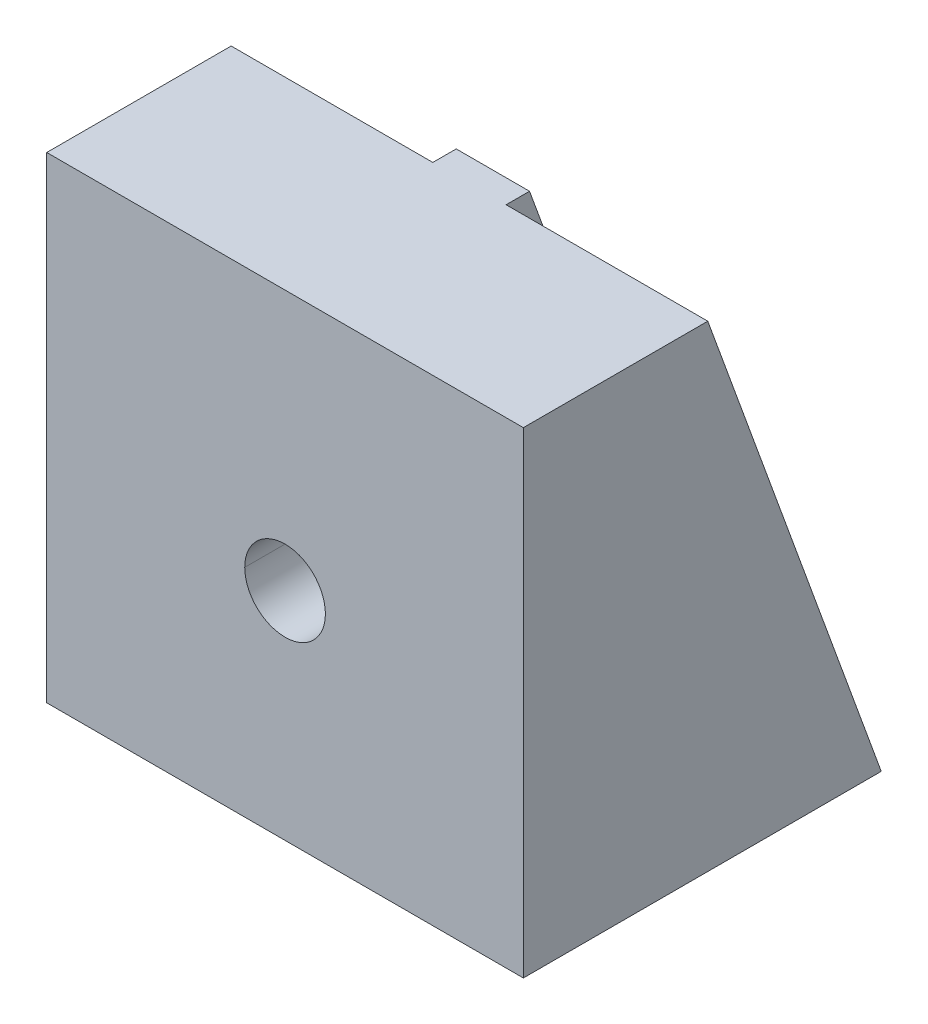
ISO-10303-21;
HEADER;
FILE_DESCRIPTION(('STEP AP214'),'2;1');
FILE_NAME('part.step','',(''),(''),'','','');
FILE_SCHEMA(('AUTOMOTIVE_DESIGN { 1 0 10303 214 1 1 1 1 }'));
ENDSEC;
DATA;
#1=APPLICATION_CONTEXT('core data for automotive mechanical design processes');
#2=APPLICATION_PROTOCOL_DEFINITION('international standard','automotive_design',2000,#1);
#3=PRODUCT_CONTEXT('',#1,'mechanical');
#4=PRODUCT('Part','Part','',(#3));
#5=PRODUCT_RELATED_PRODUCT_CATEGORY('part','',(#4));
#6=PRODUCT_DEFINITION_FORMATION('','',#4);
#7=PRODUCT_DEFINITION_CONTEXT('part definition',#1,'design');
#8=PRODUCT_DEFINITION('design','',#6,#7);
#9=PRODUCT_DEFINITION_SHAPE('','',#8);
#10=(LENGTH_UNIT() NAMED_UNIT(*) SI_UNIT(.MILLI.,.METRE.));
#11=(NAMED_UNIT(*) PLANE_ANGLE_UNIT() SI_UNIT($,.RADIAN.));
#12=(NAMED_UNIT(*) SI_UNIT($,.STERADIAN.) SOLID_ANGLE_UNIT());
#13=UNCERTAINTY_MEASURE_WITH_UNIT(LENGTH_MEASURE(1.E-05),#10,'distance_accuracy_value','');
#14=(GEOMETRIC_REPRESENTATION_CONTEXT(3) GLOBAL_UNCERTAINTY_ASSIGNED_CONTEXT((#13)) GLOBAL_UNIT_ASSIGNED_CONTEXT((#10,
#11,#12)) REPRESENTATION_CONTEXT('',''));
#15=CARTESIAN_POINT('',(0.,0.,0.));
#16=DIRECTION('',(0.,0.,1.));
#17=DIRECTION('',(1.,0.,0.));
#18=AXIS2_PLACEMENT_3D('',#15,#16,#17);
#19=CARTESIAN_POINT('',(0.,29.50000000001,-26.89999999999));
#20=DIRECTION('',(0.,0.,-1.));
#21=DIRECTION('',(-1.,0.,0.));
#22=AXIS2_PLACEMENT_3D('',#19,#20,#21);
#23=PLANE('',#22);
#24=CARTESIAN_POINT('',(0.,29.50000000001,-26.89999999999));
#25=DIRECTION('',(0.,0.,1.));
#26=DIRECTION('',(1.,0.,0.));
#27=AXIS2_PLACEMENT_3D('',#24,#25,#26);
#28=CIRCLE('',#27,3.1);
#29=CARTESIAN_POINT('',(-3.1,29.50000000001,-26.89999999999));
#30=VERTEX_POINT('',#29);
#31=CARTESIAN_POINT('',(3.1,29.50000000001,-26.89999999999));
#32=VERTEX_POINT('',#31);
#33=EDGE_CURVE('E112',#30,#32,#28,.T.);
#34=ORIENTED_EDGE('',*,*,#33,.T.);
#35=CARTESIAN_POINT('',(0.,29.50000000001,-26.89999999999));
#36=DIRECTION('',(0.,0.,1.));
#37=DIRECTION('',(1.,0.,0.));
#38=AXIS2_PLACEMENT_3D('',#35,#36,#37);
#39=CIRCLE('',#38,3.1);
#40=EDGE_CURVE('E111',#32,#30,#39,.T.);
#41=ORIENTED_EDGE('',*,*,#40,.T.);
#42=EDGE_LOOP('',(#34,#41));
#43=FACE_BOUND('',#42,.T.);
#44=CARTESIAN_POINT('',(0.,29.50000000001,-26.89999999999));
#45=DIRECTION('',(0.,0.,-1.));
#46=DIRECTION('',(-1.,0.,0.));
#47=AXIS2_PLACEMENT_3D('',#44,#45,#46);
#48=CIRCLE('',#47,13.);
#49=CARTESIAN_POINT('',(13.,29.50000000001,-26.89999999999));
#50=VERTEX_POINT('',#49);
#51=CARTESIAN_POINT('',(-13.,29.50000000001,-26.89999999999));
#52=VERTEX_POINT('',#51);
#53=EDGE_CURVE('E18',#50,#52,#48,.T.);
#54=ORIENTED_EDGE('',*,*,#53,.T.);
#55=CARTESIAN_POINT('',(0.,29.50000000001,-26.89999999999));
#56=DIRECTION('',(0.,0.,-1.));
#57=DIRECTION('',(-1.,0.,0.));
#58=AXIS2_PLACEMENT_3D('',#55,#56,#57);
#59=CIRCLE('',#58,13.);
#60=EDGE_CURVE('E97',#52,#50,#59,.T.);
#61=ORIENTED_EDGE('',*,*,#60,.T.);
#62=EDGE_LOOP('',(#54,#61));
#63=FACE_BOUND('',#62,.T.);
#64=ADVANCED_FACE('F15',(#43,#63),#23,.T.);
#65=CARTESIAN_POINT('',(0.,29.50000000001,-26.89999999999));
#66=DIRECTION('',(0.,0.,-1.));
#67=DIRECTION('',(-1.,0.,0.));
#68=AXIS2_PLACEMENT_3D('',#65,#66,#67);
#69=CYLINDRICAL_SURFACE('',#68,13.);
#70=CARTESIAN_POINT('',(0.,29.50000000001,-38.0703447717141));
#71=DIRECTION('',(0.,0.342020143325699,-0.939692620785897));
#72=DIRECTION('',(0.,-0.939692620785897,-0.342020143325699));
#73=AXIS2_PLACEMENT_3D('',#70,#71,#72);
#74=ELLIPSE('',#73,13.834311042187,13.);
#75=CARTESIAN_POINT('',(5.,17.500000000005,-42.4379875829108));
#76=VERTEX_POINT('',#75);
#77=CARTESIAN_POINT('',(13.,29.5000000000096,-38.070344771716));
#78=VERTEX_POINT('',#77);
#79=EDGE_CURVE('E122',#76,#78,#74,.F.);
#80=ORIENTED_EDGE('',*,*,#79,.F.);
#81=DIRECTION('',(0.,0.,-1.));
#82=VECTOR('',#81,1.);
#83=CARTESIAN_POINT('',(5.,17.5,-25.02655820628));
#84=LINE('',#83,#82);
#85=CARTESIAN_POINT('',(4.9999999999995,17.5000000000048,-45.6305209003384));
#86=VERTEX_POINT('',#85);
#87=EDGE_CURVE('E121',#86,#76,#84,.F.);
#88=ORIENTED_EDGE('',*,*,#87,.F.);
#89=CARTESIAN_POINT('',(0.,29.50000000001,-41.2628780891416));
#90=DIRECTION('',(0.,0.342020143325699,-0.939692620785897));
#91=DIRECTION('',(0.,-0.939692620785897,-0.342020143325699));
#92=AXIS2_PLACEMENT_3D('',#89,#90,#91);
#93=ELLIPSE('',#92,13.834311042187,13.);
#94=CARTESIAN_POINT('',(-5.,17.50000000001,-45.6305209003383));
#95=VERTEX_POINT('',#94);
#96=EDGE_CURVE('E117',#95,#86,#93,.F.);
#97=ORIENTED_EDGE('',*,*,#96,.F.);
#98=DIRECTION('',(0.,0.,-1.));
#99=VECTOR('',#98,1.);
#100=CARTESIAN_POINT('',(-5.,17.50000000001,-25.02655820628));
#101=LINE('',#100,#99);
#102=CARTESIAN_POINT('',(-5.,17.50000000001,-42.437987582909));
#103=VERTEX_POINT('',#102);
#104=EDGE_CURVE('E163',#95,#103,#101,.F.);
#105=ORIENTED_EDGE('',*,*,#104,.T.);
#106=CARTESIAN_POINT('',(0.,29.50000000001,-38.0703447717141));
#107=DIRECTION('',(0.,-0.342020143325699,0.939692620785897));
#108=DIRECTION('',(0.,-0.939692620785897,-0.342020143325699));
#109=AXIS2_PLACEMENT_3D('',#106,#107,#108);
#110=ELLIPSE('',#109,13.834311042187,13.);
#111=CARTESIAN_POINT('',(-13.,29.5000000000096,-38.070344771716));
#112=VERTEX_POINT('',#111);
#113=EDGE_CURVE('E105',#103,#112,#110,.F.);
#114=ORIENTED_EDGE('',*,*,#113,.T.);
#115=DIRECTION('',(0.,0.,-1.));
#116=VECTOR('',#115,1.);
#117=CARTESIAN_POINT('',(-13.,29.50000000001,-26.89999999999));
#118=LINE('',#117,#116);
#119=EDGE_CURVE('E101',#112,#52,#118,.F.);
#120=ORIENTED_EDGE('',*,*,#119,.T.);
#121=ORIENTED_EDGE('',*,*,#53,.F.);
#122=DIRECTION('',(0.,0.,-1.));
#123=VECTOR('',#122,1.);
#124=CARTESIAN_POINT('',(13.,29.50000000001,-26.89999999999));
#125=LINE('',#124,#123);
#126=EDGE_CURVE('E99',#50,#78,#125,.T.);
#127=ORIENTED_EDGE('',*,*,#126,.T.);
#128=EDGE_LOOP('',(#80,#88,#97,#105,#114,#120,#121,#127));
#129=FACE_BOUND('',#128,.T.);
#130=ADVANCED_FACE('F103',(#129),#69,.F.);
#131=CARTESIAN_POINT('',(0.,29.50000000001,-26.89999999999));
#132=DIRECTION('',(0.,0.,-1.));
#133=DIRECTION('',(-1.,0.,0.));
#134=AXIS2_PLACEMENT_3D('',#131,#132,#133);
#135=CYLINDRICAL_SURFACE('',#134,13.);
#136=ORIENTED_EDGE('',*,*,#119,.F.);
#137=CARTESIAN_POINT('',(0.,29.50000000001,-38.0703447717141));
#138=DIRECTION('',(0.,-0.342020143325699,0.939692620785897));
#139=DIRECTION('',(0.,-0.939692620785897,-0.342020143325699));
#140=AXIS2_PLACEMENT_3D('',#137,#138,#139);
#141=ELLIPSE('',#140,13.834311042187,13.);
#142=CARTESIAN_POINT('',(-5.,41.50000000001,-33.7027019605196));
#143=VERTEX_POINT('',#142);
#144=EDGE_CURVE('E131',#112,#143,#141,.F.);
#145=ORIENTED_EDGE('',*,*,#144,.T.);
#146=DIRECTION('',(0.,0.,-1.));
#147=VECTOR('',#146,1.);
#148=CARTESIAN_POINT('',(-5.,41.50000000001,-25.02655820628));
#149=LINE('',#148,#147);
#150=CARTESIAN_POINT('',(-5.0000000000005,41.5000000000098,-36.8952352779468));
#151=VERTEX_POINT('',#150);
#152=EDGE_CURVE('E134',#143,#151,#149,.T.);
#153=ORIENTED_EDGE('',*,*,#152,.T.);
#154=CARTESIAN_POINT('',(0.,29.50000000001,-41.2628780891416));
#155=DIRECTION('',(0.,0.342020143325699,-0.939692620785897));
#156=DIRECTION('',(0.,-0.939692620785897,-0.342020143325699));
#157=AXIS2_PLACEMENT_3D('',#154,#155,#156);
#158=ELLIPSE('',#157,13.834311042187,13.);
#159=CARTESIAN_POINT('',(5.,41.50000000001,-36.8952352779468));
#160=VERTEX_POINT('',#159);
#161=EDGE_CURVE('E135',#160,#151,#158,.F.);
#162=ORIENTED_EDGE('',*,*,#161,.F.);
#163=DIRECTION('',(0.,0.,-1.));
#164=VECTOR('',#163,1.);
#165=CARTESIAN_POINT('',(5.,41.50000000001,-25.02655820628));
#166=LINE('',#165,#164);
#167=CARTESIAN_POINT('',(5.,41.50000000001,-33.7027019605193));
#168=VERTEX_POINT('',#167);
#169=EDGE_CURVE('E162',#168,#160,#166,.T.);
#170=ORIENTED_EDGE('',*,*,#169,.F.);
#171=CARTESIAN_POINT('',(0.,29.50000000001,-38.0703447717141));
#172=DIRECTION('',(0.,0.342020143325699,-0.939692620785897));
#173=DIRECTION('',(0.,-0.939692620785897,-0.342020143325699));
#174=AXIS2_PLACEMENT_3D('',#171,#172,#173);
#175=ELLIPSE('',#174,13.834311042187,13.);
#176=EDGE_CURVE('E125',#78,#168,#175,.F.);
#177=ORIENTED_EDGE('',*,*,#176,.F.);
#178=ORIENTED_EDGE('',*,*,#126,.F.);
#179=ORIENTED_EDGE('',*,*,#60,.F.);
#180=EDGE_LOOP('',(#136,#145,#153,#162,#170,#177,#178,#179));
#181=FACE_BOUND('',#180,.T.);
#182=ADVANCED_FACE('F109',(#181),#135,.F.);
#183=CARTESIAN_POINT('',(0.,29.50000000001,-26.89999999999));
#184=DIRECTION('',(0.,0.,1.));
#185=DIRECTION('',(1.,0.,0.));
#186=AXIS2_PLACEMENT_3D('',#183,#184,#185);
#187=CYLINDRICAL_SURFACE('',#186,3.1);
#188=DIRECTION('',(0.,0.,1.));
#189=VECTOR('',#188,1.);
#190=CARTESIAN_POINT('',(3.1,29.50000000001,-26.89999999999));
#191=LINE('',#190,#189);
#192=CARTESIAN_POINT('',(3.1,29.50000000001,-22.3));
#193=VERTEX_POINT('',#192);
#194=EDGE_CURVE('E116',#32,#193,#191,.T.);
#195=ORIENTED_EDGE('',*,*,#194,.T.);
#196=CARTESIAN_POINT('',(0.,29.50000000001,-22.3));
#197=DIRECTION('',(0.,0.,1.));
#198=DIRECTION('',(1.,0.,0.));
#199=AXIS2_PLACEMENT_3D('',#196,#197,#198);
#200=CIRCLE('',#199,3.1);
#201=CARTESIAN_POINT('',(-3.1,29.50000000001,-22.3));
#202=VERTEX_POINT('',#201);
#203=EDGE_CURVE('E138',#202,#193,#200,.F.);
#204=ORIENTED_EDGE('',*,*,#203,.F.);
#205=DIRECTION('',(0.,0.,1.));
#206=VECTOR('',#205,1.);
#207=CARTESIAN_POINT('',(-3.1,29.50000000001,-26.89999999999));
#208=LINE('',#207,#206);
#209=EDGE_CURVE('E170',#202,#30,#208,.F.);
#210=ORIENTED_EDGE('',*,*,#209,.T.);
#211=ORIENTED_EDGE('',*,*,#40,.F.);
#212=EDGE_LOOP('',(#195,#204,#210,#211));
#213=FACE_BOUND('',#212,.T.);
#214=ADVANCED_FACE('F442',(#213),#187,.F.);
#215=CARTESIAN_POINT('',(0.,29.50000000001,-26.89999999999));
#216=DIRECTION('',(0.,0.,1.));
#217=DIRECTION('',(1.,0.,0.));
#218=AXIS2_PLACEMENT_3D('',#215,#216,#217);
#219=CYLINDRICAL_SURFACE('',#218,3.1);
#220=CARTESIAN_POINT('',(0.,29.50000000001,-22.3));
#221=DIRECTION('',(0.,0.,1.));
#222=DIRECTION('',(1.,0.,0.));
#223=AXIS2_PLACEMENT_3D('',#220,#221,#222);
#224=CIRCLE('',#223,3.1);
#225=EDGE_CURVE('E142',#193,#202,#224,.F.);
#226=ORIENTED_EDGE('',*,*,#225,.F.);
#227=ORIENTED_EDGE('',*,*,#194,.F.);
#228=ORIENTED_EDGE('',*,*,#33,.F.);
#229=ORIENTED_EDGE('',*,*,#209,.F.);
#230=EDGE_LOOP('',(#226,#227,#228,#229));
#231=FACE_BOUND('',#230,.T.);
#232=ADVANCED_FACE('F435',(#231),#219,.F.);
#233=CARTESIAN_POINT('',(5.,74.10892225321,-25.02655820628));
#234=DIRECTION('',(1.,0.,0.));
#235=DIRECTION('',(0.,0.,-1.));
#236=AXIS2_PLACEMENT_3D('',#233,#234,#235);
#237=PLANE('',#236);
#238=DIRECTION('',(0.,0.939692620785897,0.342020143325699));
#239=VECTOR('',#238,1.);
#240=CARTESIAN_POINT('',(4.999999999999,74.10892225321,-25.02655820628));
#241=LINE('',#240,#239);
#242=CARTESIAN_POINT('',(4.99999999999959,0.,-51.9999999999996));
#243=VERTEX_POINT('',#242);
#244=EDGE_CURVE('E120',#86,#243,#241,.F.);
#245=ORIENTED_EDGE('',*,*,#244,.F.);
#246=ORIENTED_EDGE('',*,*,#87,.T.);
#247=DIRECTION('',(0.,0.939692620785897,0.342020143325699));
#248=VECTOR('',#247,1.);
#249=CARTESIAN_POINT('',(5.,73.08286182324,-22.20748034392));
#250=LINE('',#249,#248);
#251=CARTESIAN_POINT('',(5.,2.08860706507608E-12,-48.8074666825711));
#252=VERTEX_POINT('',#251);
#253=EDGE_CURVE('E126',#252,#76,#250,.T.);
#254=ORIENTED_EDGE('',*,*,#253,.F.);
#255=DIRECTION('',(0.,0.,1.));
#256=VECTOR('',#255,1.);
#257=CARTESIAN_POINT('',(5.,0.,0.));
#258=LINE('',#257,#256);
#259=EDGE_CURVE('E158',#252,#243,#258,.F.);
#260=ORIENTED_EDGE('',*,*,#259,.T.);
#261=EDGE_LOOP('',(#245,#246,#254,#260));
#262=FACE_BOUND('',#261,.T.);
#263=ADVANCED_FACE('F291',(#262),#237,.T.);
#264=CARTESIAN_POINT('',(-5.,74.10892225321,-25.02655820628));
#265=DIRECTION('',(0.,0.342020143325699,-0.939692620785897));
#266=DIRECTION('',(0.,0.939692620785897,0.342020143325699));
#267=AXIS2_PLACEMENT_3D('',#264,#265,#266);
#268=PLANE('',#267);
#269=ORIENTED_EDGE('',*,*,#244,.T.);
#270=DIRECTION('',(1.,0.,0.));
#271=VECTOR('',#270,1.);
#272=CARTESIAN_POINT('',(32.5,0.,-52.));
#273=LINE('',#272,#271);
#274=CARTESIAN_POINT('',(-5.,3.27527032440344E-13,-51.9999999999997));
#275=VERTEX_POINT('',#274);
#276=EDGE_CURVE('E154',#243,#275,#273,.F.);
#277=ORIENTED_EDGE('',*,*,#276,.T.);
#278=DIRECTION('',(0.,0.939692620785943,0.342020143325573));
#279=VECTOR('',#278,1.);
#280=CARTESIAN_POINT('',(-5.,4.16333634234434E-13,-52.));
#281=LINE('',#280,#279);
#282=EDGE_CURVE('E159',#275,#95,#281,.T.);
#283=ORIENTED_EDGE('',*,*,#282,.T.);
#284=ORIENTED_EDGE('',*,*,#96,.T.);
#285=EDGE_LOOP('',(#269,#277,#283,#284));
#286=FACE_BOUND('',#285,.T.);
#287=ADVANCED_FACE('F295',(#286),#268,.T.);
#288=CARTESIAN_POINT('',(-5.,74.10892225321,-25.02655820628));
#289=DIRECTION('',(1.,0.,0.));
#290=DIRECTION('',(0.,0.,-1.));
#291=AXIS2_PLACEMENT_3D('',#288,#289,#290);
#292=PLANE('',#291);
#293=DIRECTION('',(0.,0.,1.));
#294=VECTOR('',#293,1.);
#295=CARTESIAN_POINT('',(-5.,0.,0.));
#296=LINE('',#295,#294);
#297=CARTESIAN_POINT('',(-5.,2.08860706507608E-12,-48.8074666825711));
#298=VERTEX_POINT('',#297);
#299=EDGE_CURVE('E157',#275,#298,#296,.T.);
#300=ORIENTED_EDGE('',*,*,#299,.T.);
#301=DIRECTION('',(0.,-0.939692620785897,-0.342020143325699));
#302=VECTOR('',#301,1.);
#303=CARTESIAN_POINT('',(-5.,73.08286182324,-22.20748034392));
#304=LINE('',#303,#302);
#305=EDGE_CURVE('E132',#298,#103,#304,.F.);
#306=ORIENTED_EDGE('',*,*,#305,.T.);
#307=ORIENTED_EDGE('',*,*,#104,.F.);
#308=ORIENTED_EDGE('',*,*,#282,.F.);
#309=EDGE_LOOP('',(#300,#306,#307,#308));
#310=FACE_BOUND('',#309,.T.);
#311=ADVANCED_FACE('F304',(#310),#292,.F.);
#312=CARTESIAN_POINT('',(5.,74.10892225321,-25.02655820628));
#313=DIRECTION('',(1.,0.,0.));
#314=DIRECTION('',(0.,0.,-1.));
#315=AXIS2_PLACEMENT_3D('',#312,#313,#314);
#316=PLANE('',#315);
#317=DIRECTION('',(0.,0.939692620785897,0.342020143325699));
#318=VECTOR('',#317,1.);
#319=CARTESIAN_POINT('',(5.,73.08286182324,-22.20748034392));
#320=LINE('',#319,#318);
#321=CARTESIAN_POINT('',(5.,64.99999999999,-25.1494014552691));
#322=VERTEX_POINT('',#321);
#323=EDGE_CURVE('E129',#168,#322,#320,.T.);
#324=ORIENTED_EDGE('',*,*,#323,.F.);
#325=ORIENTED_EDGE('',*,*,#169,.T.);
#326=DIRECTION('',(0.,0.939692620785897,0.342020143325699));
#327=VECTOR('',#326,1.);
#328=CARTESIAN_POINT('',(5.,74.10892225321,-25.02655820628));
#329=LINE('',#328,#327);
#330=CARTESIAN_POINT('',(5.,65.0000000000012,-28.3419347726934));
#331=VERTEX_POINT('',#330);
#332=EDGE_CURVE('E139',#331,#160,#329,.F.);
#333=ORIENTED_EDGE('',*,*,#332,.F.);
#334=DIRECTION('',(0.,0.,-1.));
#335=VECTOR('',#334,1.);
#336=CARTESIAN_POINT('',(5.,64.99999999999,-52.));
#337=LINE('',#336,#335);
#338=EDGE_CURVE('E175',#331,#322,#337,.F.);
#339=ORIENTED_EDGE('',*,*,#338,.T.);
#340=EDGE_LOOP('',(#324,#325,#333,#339));
#341=FACE_BOUND('',#340,.T.);
#342=ADVANCED_FACE('F321',(#341),#316,.T.);
#343=CARTESIAN_POINT('',(5.,73.08286182324,-22.20748034392));
#344=DIRECTION('',(0.,0.342020143325699,-0.939692620785897));
#345=DIRECTION('',(0.,0.939692620785897,0.342020143325699));
#346=AXIS2_PLACEMENT_3D('',#343,#344,#345);
#347=PLANE('',#346);
#348=ORIENTED_EDGE('',*,*,#323,.T.);
#349=DIRECTION('',(1.,0.,0.));
#350=VECTOR('',#349,1.);
#351=CARTESIAN_POINT('',(32.5,64.99999999999,-25.14940145527));
#352=LINE('',#351,#350);
#353=CARTESIAN_POINT('',(32.5,64.99999999999,-25.14940145527));
#354=VERTEX_POINT('',#353);
#355=EDGE_CURVE('E171',#322,#354,#352,.T.);
#356=ORIENTED_EDGE('',*,*,#355,.T.);
#357=DIRECTION('',(0.,0.939692620785903,0.342020143325683));
#358=VECTOR('',#357,1.);
#359=CARTESIAN_POINT('',(32.5,1.72084568816899E-12,-48.80746668257));
#360=LINE('',#359,#358);
#361=CARTESIAN_POINT('',(32.5,5.29164426354764E-13,-48.8074666825704));
#362=VERTEX_POINT('',#361);
#363=EDGE_CURVE('E197',#362,#354,#360,.T.);
#364=ORIENTED_EDGE('',*,*,#363,.F.);
#365=DIRECTION('',(1.,0.,0.));
#366=VECTOR('',#365,1.);
#367=CARTESIAN_POINT('',(32.5,0.,-48.80746668257));
#368=LINE('',#367,#366);
#369=EDGE_CURVE('E166',#362,#252,#368,.F.);
#370=ORIENTED_EDGE('',*,*,#369,.T.);
#371=ORIENTED_EDGE('',*,*,#253,.T.);
#372=ORIENTED_EDGE('',*,*,#79,.T.);
#373=ORIENTED_EDGE('',*,*,#176,.T.);
#374=EDGE_LOOP('',(#348,#356,#364,#370,#371,#372,#373));
#375=FACE_BOUND('',#374,.T.);
#376=ADVANCED_FACE('F323',(#375),#347,.T.);
#377=CARTESIAN_POINT('',(-5.,73.08286182324,-22.20748034392));
#378=DIRECTION('',(0.,-0.342020143325699,0.939692620785897));
#379=DIRECTION('',(0.,-0.939692620785897,-0.342020143325699));
#380=AXIS2_PLACEMENT_3D('',#377,#378,#379);
#381=PLANE('',#380);
#382=ORIENTED_EDGE('',*,*,#144,.F.);
#383=ORIENTED_EDGE('',*,*,#113,.F.);
#384=ORIENTED_EDGE('',*,*,#305,.F.);
#385=DIRECTION('',(1.,0.,0.));
#386=VECTOR('',#385,1.);
#387=CARTESIAN_POINT('',(32.5,0.,-48.80746668257));
#388=LINE('',#387,#386);
#389=CARTESIAN_POINT('',(-32.5,1.05822172119962E-12,-48.8074666825707));
#390=VERTEX_POINT('',#389);
#391=EDGE_CURVE('E176',#298,#390,#388,.F.);
#392=ORIENTED_EDGE('',*,*,#391,.T.);
#393=DIRECTION('',(0.,0.939692620785903,0.342020143325683));
#394=VECTOR('',#393,1.);
#395=CARTESIAN_POINT('',(-32.5,1.72084568816899E-12,-48.80746668257));
#396=LINE('',#395,#394);
#397=CARTESIAN_POINT('',(-32.5,64.99999999999,-25.14940145527));
#398=VERTEX_POINT('',#397);
#399=EDGE_CURVE('E145',#390,#398,#396,.T.);
#400=ORIENTED_EDGE('',*,*,#399,.T.);
#401=DIRECTION('',(1.,0.,0.));
#402=VECTOR('',#401,1.);
#403=CARTESIAN_POINT('',(32.5,64.99999999999,-25.14940145527));
#404=LINE('',#403,#402);
#405=CARTESIAN_POINT('',(-5.,64.9999999999913,-25.1494014552691));
#406=VERTEX_POINT('',#405);
#407=EDGE_CURVE('E183',#398,#406,#404,.T.);
#408=ORIENTED_EDGE('',*,*,#407,.T.);
#409=DIRECTION('',(0.,-0.939692620785889,-0.342020143325723));
#410=VECTOR('',#409,1.);
#411=CARTESIAN_POINT('',(-5.,64.99999999999,-25.14940145527));
#412=LINE('',#411,#410);
#413=EDGE_CURVE('E188',#406,#143,#412,.T.);
#414=ORIENTED_EDGE('',*,*,#413,.T.);
#415=EDGE_LOOP('',(#382,#383,#384,#392,#400,#408,#414));
#416=FACE_BOUND('',#415,.T.);
#417=ADVANCED_FACE('F307',(#416),#381,.F.);
#418=CARTESIAN_POINT('',(-5.,74.10892225321,-25.02655820628));
#419=DIRECTION('',(1.,0.,0.));
#420=DIRECTION('',(0.,0.,-1.));
#421=AXIS2_PLACEMENT_3D('',#418,#419,#420);
#422=PLANE('',#421);
#423=DIRECTION('',(0.,0.,-1.));
#424=VECTOR('',#423,1.);
#425=CARTESIAN_POINT('',(-5.,64.99999999999,-52.));
#426=LINE('',#425,#424);
#427=CARTESIAN_POINT('',(-5.00000000000062,64.9999999999956,-28.3419347726917));
#428=VERTEX_POINT('',#427);
#429=EDGE_CURVE('E186',#406,#428,#426,.T.);
#430=ORIENTED_EDGE('',*,*,#429,.T.);
#431=DIRECTION('',(0.,0.939692620785897,0.342020143325699));
#432=VECTOR('',#431,1.);
#433=CARTESIAN_POINT('',(-5.000000000001,74.10892225321,-25.02655820628));
#434=LINE('',#433,#432);
#435=EDGE_CURVE('E191',#151,#428,#434,.T.);
#436=ORIENTED_EDGE('',*,*,#435,.F.);
#437=ORIENTED_EDGE('',*,*,#152,.F.);
#438=ORIENTED_EDGE('',*,*,#413,.F.);
#439=EDGE_LOOP('',(#430,#436,#437,#438));
#440=FACE_BOUND('',#439,.T.);
#441=ADVANCED_FACE('F314',(#440),#422,.F.);
#442=CARTESIAN_POINT('',(-5.,74.10892225321,-25.02655820628));
#443=DIRECTION('',(0.,0.342020143325699,-0.939692620785897));
#444=DIRECTION('',(0.,0.939692620785897,0.342020143325699));
#445=AXIS2_PLACEMENT_3D('',#442,#443,#444);
#446=PLANE('',#445);
#447=ORIENTED_EDGE('',*,*,#332,.T.);
#448=ORIENTED_EDGE('',*,*,#161,.T.);
#449=ORIENTED_EDGE('',*,*,#435,.T.);
#450=DIRECTION('',(1.,0.,0.));
#451=VECTOR('',#450,1.);
#452=CARTESIAN_POINT('',(32.5,64.99999999999,-28.34193477269));
#453=LINE('',#452,#451);
#454=EDGE_CURVE('E149',#428,#331,#453,.T.);
#455=ORIENTED_EDGE('',*,*,#454,.T.);
#456=EDGE_LOOP('',(#447,#448,#449,#455));
#457=FACE_BOUND('',#456,.T.);
#458=ADVANCED_FACE('F317',(#457),#446,.T.);
#459=CARTESIAN_POINT('',(0.,29.50000000001,-22.3));
#460=DIRECTION('',(0.,0.,1.));
#461=DIRECTION('',(1.,0.,0.));
#462=AXIS2_PLACEMENT_3D('',#459,#460,#461);
#463=PLANE('',#462);
#464=ORIENTED_EDGE('',*,*,#203,.T.);
#465=ORIENTED_EDGE('',*,*,#225,.T.);
#466=EDGE_LOOP('',(#464,#465));
#467=FACE_BOUND('',#466,.T.);
#468=CARTESIAN_POINT('',(0.,29.50000000001,-22.3));
#469=DIRECTION('',(0.,0.,1.));
#470=DIRECTION('',(1.,0.,0.));
#471=AXIS2_PLACEMENT_3D('',#468,#469,#470);
#472=CIRCLE('',#471,5.500000000001);
#473=CARTESIAN_POINT('',(-5.500000000001,29.50000000001,-22.3));
#474=VERTEX_POINT('',#473);
#475=CARTESIAN_POINT('',(5.500000000001,29.50000000001,-22.3));
#476=VERTEX_POINT('',#475);
#477=EDGE_CURVE('E148',#474,#476,#472,.T.);
#478=ORIENTED_EDGE('',*,*,#477,.T.);
#479=CARTESIAN_POINT('',(0.,29.50000000001,-22.3));
#480=DIRECTION('',(0.,0.,1.));
#481=DIRECTION('',(1.,0.,0.));
#482=AXIS2_PLACEMENT_3D('',#479,#480,#481);
#483=CIRCLE('',#482,5.500000000001);
#484=EDGE_CURVE('E146',#476,#474,#483,.T.);
#485=ORIENTED_EDGE('',*,*,#484,.T.);
#486=EDGE_LOOP('',(#478,#485));
#487=FACE_BOUND('',#486,.T.);
#488=ADVANCED_FACE('F378',(#467,#487),#463,.T.);
#489=CARTESIAN_POINT('',(-32.5,64.99999999999,0.));
#490=DIRECTION('',(1.,0.,0.));
#491=DIRECTION('',(0.,0.,-1.));
#492=AXIS2_PLACEMENT_3D('',#489,#490,#491);
#493=PLANE('',#492);
#494=DIRECTION('',(0.,1.,0.));
#495=VECTOR('',#494,1.);
#496=CARTESIAN_POINT('',(-32.5,0.,0.));
#497=LINE('',#496,#495);
#498=CARTESIAN_POINT('',(-32.5,64.99999999999,0.));
#499=VERTEX_POINT('',#498);
#500=CARTESIAN_POINT('',(-32.5,0.,0.));
#501=VERTEX_POINT('',#500);
#502=EDGE_CURVE('E233',#499,#501,#497,.F.);
#503=ORIENTED_EDGE('',*,*,#502,.F.);
#504=DIRECTION('',(0.,0.,-1.));
#505=VECTOR('',#504,1.);
#506=CARTESIAN_POINT('',(-32.5,64.99999999999,-52.));
#507=LINE('',#506,#505);
#508=EDGE_CURVE('E187',#499,#398,#507,.T.);
#509=ORIENTED_EDGE('',*,*,#508,.T.);
#510=ORIENTED_EDGE('',*,*,#399,.F.);
#511=DIRECTION('',(0.,0.,1.));
#512=VECTOR('',#511,1.);
#513=CARTESIAN_POINT('',(-32.5,0.,0.));
#514=LINE('',#513,#512);
#515=EDGE_CURVE('E179',#390,#501,#514,.T.);
#516=ORIENTED_EDGE('',*,*,#515,.T.);
#517=EDGE_LOOP('',(#503,#509,#510,#516));
#518=FACE_BOUND('',#517,.T.);
#519=ADVANCED_FACE('F335',(#518),#493,.F.);
#520=CARTESIAN_POINT('',(32.5,0.,0.));
#521=DIRECTION('',(0.,1.,0.));
#522=DIRECTION('',(0.,0.,1.));
#523=AXIS2_PLACEMENT_3D('',#520,#521,#522);
#524=PLANE('',#523);
#525=DIRECTION('',(1.,0.,0.));
#526=VECTOR('',#525,1.);
#527=CARTESIAN_POINT('',(32.5,0.,0.));
#528=LINE('',#527,#526);
#529=CARTESIAN_POINT('',(32.5,0.,0.));
#530=VERTEX_POINT('',#529);
#531=EDGE_CURVE('E237',#501,#530,#528,.T.);
#532=ORIENTED_EDGE('',*,*,#531,.F.);
#533=ORIENTED_EDGE('',*,*,#515,.F.);
#534=ORIENTED_EDGE('',*,*,#391,.F.);
#535=ORIENTED_EDGE('',*,*,#299,.F.);
#536=ORIENTED_EDGE('',*,*,#276,.F.);
#537=ORIENTED_EDGE('',*,*,#259,.F.);
#538=ORIENTED_EDGE('',*,*,#369,.F.);
#539=DIRECTION('',(0.,0.,-1.));
#540=VECTOR('',#539,1.);
#541=CARTESIAN_POINT('',(32.5,0.,0.));
#542=LINE('',#541,#540);
#543=EDGE_CURVE('E221',#530,#362,#542,.T.);
#544=ORIENTED_EDGE('',*,*,#543,.F.);
#545=EDGE_LOOP('',(#532,#533,#534,#535,#536,#537,#538,#544));
#546=FACE_BOUND('',#545,.T.);
#547=ADVANCED_FACE('F299',(#546),#524,.F.);
#548=CARTESIAN_POINT('',(32.5,64.99999999999,0.));
#549=DIRECTION('',(1.,0.,0.));
#550=DIRECTION('',(0.,0.,-1.));
#551=AXIS2_PLACEMENT_3D('',#548,#549,#550);
#552=PLANE('',#551);
#553=ORIENTED_EDGE('',*,*,#363,.T.);
#554=DIRECTION('',(0.,0.,-1.));
#555=VECTOR('',#554,1.);
#556=CARTESIAN_POINT('',(32.5,64.99999999999,-52.));
#557=LINE('',#556,#555);
#558=CARTESIAN_POINT('',(32.5,64.99999999999,0.));
#559=VERTEX_POINT('',#558);
#560=EDGE_CURVE('E174',#354,#559,#557,.F.);
#561=ORIENTED_EDGE('',*,*,#560,.T.);
#562=DIRECTION('',(0.,1.,0.));
#563=VECTOR('',#562,1.);
#564=CARTESIAN_POINT('',(32.5,0.,0.));
#565=LINE('',#564,#563);
#566=EDGE_CURVE('E240',#530,#559,#565,.T.);
#567=ORIENTED_EDGE('',*,*,#566,.F.);
#568=ORIENTED_EDGE('',*,*,#543,.T.);
#569=EDGE_LOOP('',(#553,#561,#567,#568));
#570=FACE_BOUND('',#569,.T.);
#571=ADVANCED_FACE('F325',(#570),#552,.T.);
#572=CARTESIAN_POINT('',(32.5,64.99999999999,-52.));
#573=DIRECTION('',(0.,-1.,0.));
#574=DIRECTION('',(0.,0.,-1.));
#575=AXIS2_PLACEMENT_3D('',#572,#573,#574);
#576=PLANE('',#575);
#577=ORIENTED_EDGE('',*,*,#429,.F.);
#578=ORIENTED_EDGE('',*,*,#407,.F.);
#579=ORIENTED_EDGE('',*,*,#508,.F.);
#580=DIRECTION('',(1.,0.,0.));
#581=VECTOR('',#580,1.);
#582=CARTESIAN_POINT('',(32.5,64.99999999999,0.));
#583=LINE('',#582,#581);
#584=EDGE_CURVE('E152',#559,#499,#583,.F.);
#585=ORIENTED_EDGE('',*,*,#584,.F.);
#586=ORIENTED_EDGE('',*,*,#560,.F.);
#587=ORIENTED_EDGE('',*,*,#355,.F.);
#588=ORIENTED_EDGE('',*,*,#338,.F.);
#589=ORIENTED_EDGE('',*,*,#454,.F.);
#590=EDGE_LOOP('',(#577,#578,#579,#585,#586,#587,#588,#589));
#591=FACE_BOUND('',#590,.T.);
#592=ADVANCED_FACE('F255',(#591),#576,.F.);
#593=CARTESIAN_POINT('',(0.,29.50000000001,-22.3));
#594=DIRECTION('',(0.,0.,1.));
#595=DIRECTION('',(1.,0.,0.));
#596=AXIS2_PLACEMENT_3D('',#593,#594,#595);
#597=CYLINDRICAL_SURFACE('',#596,5.500000000001);
#598=DIRECTION('',(0.,0.,1.));
#599=VECTOR('',#598,1.);
#600=CARTESIAN_POINT('',(5.500000000001,29.50000000001,-22.3));
#601=LINE('',#600,#599);
#602=CARTESIAN_POINT('',(5.500000000001,29.50000000001,0.));
#603=VERTEX_POINT('',#602);
#604=EDGE_CURVE('E33',#476,#603,#601,.T.);
#605=ORIENTED_EDGE('',*,*,#604,.T.);
#606=CARTESIAN_POINT('',(0.,29.50000000001,0.));
#607=DIRECTION('',(0.,0.,1.));
#608=DIRECTION('',(1.,0.,0.));
#609=AXIS2_PLACEMENT_3D('',#606,#607,#608);
#610=CIRCLE('',#609,5.500000000001);
#611=CARTESIAN_POINT('',(-5.500000000001,29.50000000001,0.));
#612=VERTEX_POINT('',#611);
#613=EDGE_CURVE('E24',#612,#603,#610,.F.);
#614=ORIENTED_EDGE('',*,*,#613,.F.);
#615=DIRECTION('',(0.,0.,1.));
#616=VECTOR('',#615,1.);
#617=CARTESIAN_POINT('',(-5.500000000001,29.50000000001,-22.3));
#618=LINE('',#617,#616);
#619=EDGE_CURVE('E230',#612,#474,#618,.F.);
#620=ORIENTED_EDGE('',*,*,#619,.T.);
#621=ORIENTED_EDGE('',*,*,#484,.F.);
#622=EDGE_LOOP('',(#605,#614,#620,#621));
#623=FACE_BOUND('',#622,.T.);
#624=ADVANCED_FACE('F333',(#623),#597,.F.);
#625=CARTESIAN_POINT('',(0.,29.50000000001,-22.3));
#626=DIRECTION('',(0.,0.,1.));
#627=DIRECTION('',(1.,0.,0.));
#628=AXIS2_PLACEMENT_3D('',#625,#626,#627);
#629=CYLINDRICAL_SURFACE('',#628,5.500000000001);
#630=CARTESIAN_POINT('',(0.,29.50000000001,0.));
#631=DIRECTION('',(0.,0.,1.));
#632=DIRECTION('',(1.,0.,0.));
#633=AXIS2_PLACEMENT_3D('',#630,#631,#632);
#634=CIRCLE('',#633,5.500000000001);
#635=EDGE_CURVE('E10',#603,#612,#634,.F.);
#636=ORIENTED_EDGE('',*,*,#635,.F.);
#637=ORIENTED_EDGE('',*,*,#604,.F.);
#638=ORIENTED_EDGE('',*,*,#477,.F.);
#639=ORIENTED_EDGE('',*,*,#619,.F.);
#640=EDGE_LOOP('',(#636,#637,#638,#639));
#641=FACE_BOUND('',#640,.T.);
#642=ADVANCED_FACE('F338',(#641),#629,.F.);
#643=CARTESIAN_POINT('',(32.5,0.,0.));
#644=DIRECTION('',(0.,0.,1.));
#645=DIRECTION('',(1.,0.,0.));
#646=AXIS2_PLACEMENT_3D('',#643,#644,#645);
#647=PLANE('',#646);
#648=ORIENTED_EDGE('',*,*,#613,.T.);
#649=ORIENTED_EDGE('',*,*,#635,.T.);
#650=EDGE_LOOP('',(#648,#649));
#651=FACE_BOUND('',#650,.T.);
#652=ORIENTED_EDGE('',*,*,#566,.T.);
#653=ORIENTED_EDGE('',*,*,#584,.T.);
#654=ORIENTED_EDGE('',*,*,#502,.T.);
#655=ORIENTED_EDGE('',*,*,#531,.T.);
#656=EDGE_LOOP('',(#652,#653,#654,#655));
#657=FACE_BOUND('',#656,.T.);
#658=ADVANCED_FACE('F246',(#651,#657),#647,.T.);
#659=CLOSED_SHELL('',(#64,#130,#182,#214,#232,#263,#287,#311,#342,#376,#417,#441,#458,#488,#519,
#547,#571,#592,#624,#642,#658));
#660=MANIFOLD_SOLID_BREP('B1',#659);
#661=ADVANCED_BREP_SHAPE_REPRESENTATION('',(#18,#660),#14);
#662=SHAPE_DEFINITION_REPRESENTATION(#9,#661);
ENDSEC;
END-ISO-10303-21;
